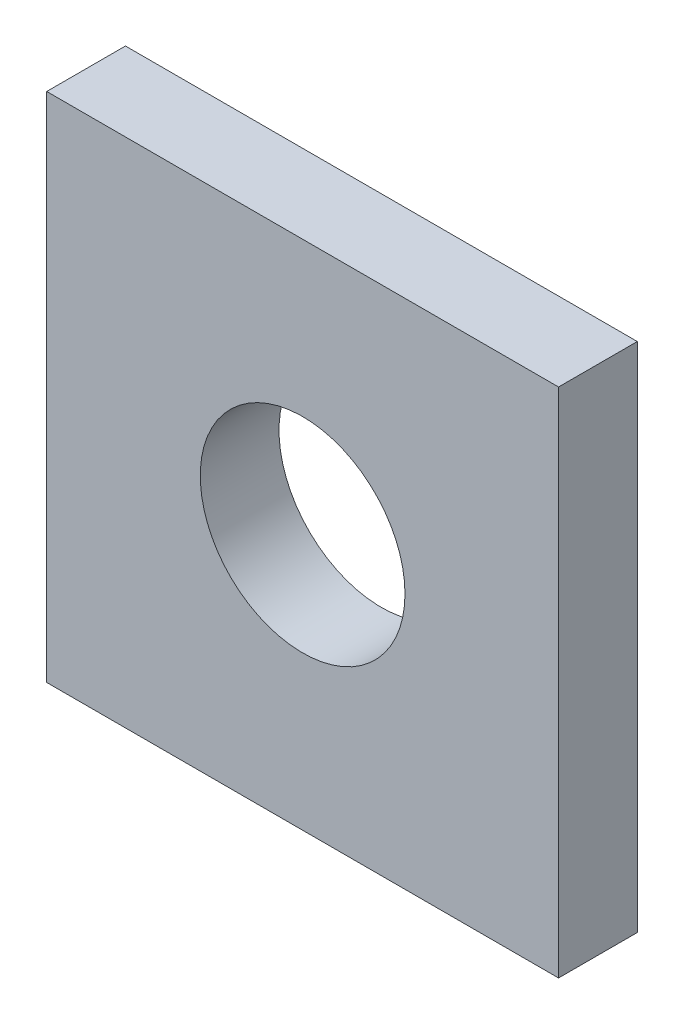
ISO-10303-21;
HEADER;
FILE_DESCRIPTION(('STEP AP214'),'2;1');
FILE_NAME('part.step','',(''),(''),'','','');
FILE_SCHEMA(('AUTOMOTIVE_DESIGN { 1 0 10303 214 1 1 1 1 }'));
ENDSEC;
DATA;
#1=APPLICATION_CONTEXT('core data for automotive mechanical design processes');
#2=APPLICATION_PROTOCOL_DEFINITION('international standard','automotive_design',2000,#1);
#3=PRODUCT_CONTEXT('',#1,'mechanical');
#4=PRODUCT('Part','Part','',(#3));
#5=PRODUCT_RELATED_PRODUCT_CATEGORY('part','',(#4));
#6=PRODUCT_DEFINITION_FORMATION('','',#4);
#7=PRODUCT_DEFINITION_CONTEXT('part definition',#1,'design');
#8=PRODUCT_DEFINITION('design','',#6,#7);
#9=PRODUCT_DEFINITION_SHAPE('','',#8);
#10=(LENGTH_UNIT() NAMED_UNIT(*) SI_UNIT(.MILLI.,.METRE.));
#11=(NAMED_UNIT(*) PLANE_ANGLE_UNIT() SI_UNIT($,.RADIAN.));
#12=(NAMED_UNIT(*) SI_UNIT($,.STERADIAN.) SOLID_ANGLE_UNIT());
#13=UNCERTAINTY_MEASURE_WITH_UNIT(LENGTH_MEASURE(1.E-05),#10,'distance_accuracy_value','');
#14=(GEOMETRIC_REPRESENTATION_CONTEXT(3) GLOBAL_UNCERTAINTY_ASSIGNED_CONTEXT((#13)) GLOBAL_UNIT_ASSIGNED_CONTEXT((#10,
#11,#12)) REPRESENTATION_CONTEXT('',''));
#15=CARTESIAN_POINT('',(0.,0.,0.));
#16=DIRECTION('',(0.,0.,1.));
#17=DIRECTION('',(1.,0.,0.));
#18=AXIS2_PLACEMENT_3D('',#15,#16,#17);
#19=CARTESIAN_POINT('',(0.,0.,0.));
#20=DIRECTION('',(0.,0.,1.));
#21=DIRECTION('',(1.,0.,0.));
#22=AXIS2_PLACEMENT_3D('',#19,#20,#21);
#23=PLANE('',#22);
#24=CARTESIAN_POINT('',(0.,0.,0.));
#25=DIRECTION('',(0.,0.,1.));
#26=DIRECTION('',(1.,0.,0.));
#27=AXIS2_PLACEMENT_3D('',#24,#25,#26);
#28=CIRCLE('',#27,2.6);
#29=CARTESIAN_POINT('',(2.6,0.,0.));
#30=VERTEX_POINT('',#29);
#31=EDGE_CURVE('E18',#30,#30,#28,.T.);
#32=ORIENTED_EDGE('',*,*,#31,.T.);
#33=EDGE_LOOP('',(#32));
#34=FACE_BOUND('',#33,.T.);
#35=DIRECTION('',(0.,1.,0.));
#36=VECTOR('',#35,1.);
#37=CARTESIAN_POINT('',(-6.5,-6.50000000000001,0.));
#38=LINE('',#37,#36);
#39=CARTESIAN_POINT('',(-6.5,6.5,0.));
#40=VERTEX_POINT('',#39);
#41=CARTESIAN_POINT('',(-6.5,-6.50000000000001,0.));
#42=VERTEX_POINT('',#41);
#43=EDGE_CURVE('E57',#40,#42,#38,.F.);
#44=ORIENTED_EDGE('',*,*,#43,.F.);
#45=DIRECTION('',(1.,0.,0.));
#46=VECTOR('',#45,1.);
#47=CARTESIAN_POINT('',(-6.5,6.5,0.));
#48=LINE('',#47,#46);
#49=CARTESIAN_POINT('',(6.5,6.5,0.));
#50=VERTEX_POINT('',#49);
#51=EDGE_CURVE('E80',#50,#40,#48,.F.);
#52=ORIENTED_EDGE('',*,*,#51,.F.);
#53=DIRECTION('',(0.,1.,0.));
#54=VECTOR('',#53,1.);
#55=CARTESIAN_POINT('',(6.5,6.50000000000001,0.));
#56=LINE('',#55,#54);
#57=CARTESIAN_POINT('',(6.5,-6.50000000000001,0.));
#58=VERTEX_POINT('',#57);
#59=EDGE_CURVE('E67',#58,#50,#56,.T.);
#60=ORIENTED_EDGE('',*,*,#59,.F.);
#61=DIRECTION('',(1.,0.,0.));
#62=VECTOR('',#61,1.);
#63=CARTESIAN_POINT('',(6.5,-6.50000000000001,0.));
#64=LINE('',#63,#62);
#65=EDGE_CURVE('E52',#42,#58,#64,.T.);
#66=ORIENTED_EDGE('',*,*,#65,.F.);
#67=EDGE_LOOP('',(#44,#52,#60,#66));
#68=FACE_BOUND('',#67,.T.);
#69=ADVANCED_FACE('F15',(#34,#68),#23,.F.);
#70=CARTESIAN_POINT('',(-6.5,-6.50000000000001,0.));
#71=DIRECTION('',(-1.,0.,0.));
#72=DIRECTION('',(0.,0.,1.));
#73=AXIS2_PLACEMENT_3D('',#70,#71,#72);
#74=PLANE('',#73);
#75=ORIENTED_EDGE('',*,*,#43,.T.);
#76=DIRECTION('',(0.,0.,-1.));
#77=VECTOR('',#76,1.);
#78=CARTESIAN_POINT('',(-6.5,-6.50000000000001,0.));
#79=LINE('',#78,#77);
#80=CARTESIAN_POINT('',(-6.5,-6.50000000000001,2.));
#81=VERTEX_POINT('',#80);
#82=EDGE_CURVE('E59',#81,#42,#79,.T.);
#83=ORIENTED_EDGE('',*,*,#82,.F.);
#84=DIRECTION('',(0.,1.,0.));
#85=VECTOR('',#84,1.);
#86=CARTESIAN_POINT('',(-6.5,0.,2.));
#87=LINE('',#86,#85);
#88=CARTESIAN_POINT('',(-6.5,6.5,2.));
#89=VERTEX_POINT('',#88);
#90=EDGE_CURVE('E83',#89,#81,#87,.F.);
#91=ORIENTED_EDGE('',*,*,#90,.F.);
#92=DIRECTION('',(0.,0.,1.));
#93=VECTOR('',#92,1.);
#94=CARTESIAN_POINT('',(-6.5,6.5,0.));
#95=LINE('',#94,#93);
#96=EDGE_CURVE('E62',#40,#89,#95,.T.);
#97=ORIENTED_EDGE('',*,*,#96,.F.);
#98=EDGE_LOOP('',(#75,#83,#91,#97));
#99=FACE_BOUND('',#98,.T.);
#100=ADVANCED_FACE('F58',(#99),#74,.T.);
#101=CARTESIAN_POINT('',(6.5,-6.50000000000001,0.));
#102=DIRECTION('',(0.,-1.,0.));
#103=DIRECTION('',(0.,0.,-1.));
#104=AXIS2_PLACEMENT_3D('',#101,#102,#103);
#105=PLANE('',#104);
#106=ORIENTED_EDGE('',*,*,#65,.T.);
#107=DIRECTION('',(0.,0.,-1.));
#108=VECTOR('',#107,1.);
#109=CARTESIAN_POINT('',(6.5,-6.50000000000001,0.));
#110=LINE('',#109,#108);
#111=CARTESIAN_POINT('',(6.5,-6.50000000000001,2.));
#112=VERTEX_POINT('',#111);
#113=EDGE_CURVE('E69',#112,#58,#110,.T.);
#114=ORIENTED_EDGE('',*,*,#113,.F.);
#115=DIRECTION('',(1.,0.,0.));
#116=VECTOR('',#115,1.);
#117=CARTESIAN_POINT('',(0.,-6.50000000000001,2.));
#118=LINE('',#117,#116);
#119=EDGE_CURVE('E73',#81,#112,#118,.T.);
#120=ORIENTED_EDGE('',*,*,#119,.F.);
#121=ORIENTED_EDGE('',*,*,#82,.T.);
#122=EDGE_LOOP('',(#106,#114,#120,#121));
#123=FACE_BOUND('',#122,.T.);
#124=ADVANCED_FACE('F71',(#123),#105,.T.);
#125=CARTESIAN_POINT('',(6.5,6.50000000000001,0.));
#126=DIRECTION('',(1.,0.,0.));
#127=DIRECTION('',(0.,0.,-1.));
#128=AXIS2_PLACEMENT_3D('',#125,#126,#127);
#129=PLANE('',#128);
#130=ORIENTED_EDGE('',*,*,#59,.T.);
#131=DIRECTION('',(0.,0.,1.));
#132=VECTOR('',#131,1.);
#133=CARTESIAN_POINT('',(6.5,6.5,0.));
#134=LINE('',#133,#132);
#135=CARTESIAN_POINT('',(6.5,6.5,2.));
#136=VERTEX_POINT('',#135);
#137=EDGE_CURVE('E32',#136,#50,#134,.F.);
#138=ORIENTED_EDGE('',*,*,#137,.F.);
#139=DIRECTION('',(0.,1.,0.));
#140=VECTOR('',#139,1.);
#141=CARTESIAN_POINT('',(6.5,0.,2.));
#142=LINE('',#141,#140);
#143=EDGE_CURVE('E86',#112,#136,#142,.T.);
#144=ORIENTED_EDGE('',*,*,#143,.F.);
#145=ORIENTED_EDGE('',*,*,#113,.T.);
#146=EDGE_LOOP('',(#130,#138,#144,#145));
#147=FACE_BOUND('',#146,.T.);
#148=ADVANCED_FACE('F96',(#147),#129,.T.);
#149=CARTESIAN_POINT('',(-6.5,6.5,0.));
#150=DIRECTION('',(0.,1.,0.));
#151=DIRECTION('',(0.,0.,1.));
#152=AXIS2_PLACEMENT_3D('',#149,#150,#151);
#153=PLANE('',#152);
#154=ORIENTED_EDGE('',*,*,#51,.T.);
#155=ORIENTED_EDGE('',*,*,#96,.T.);
#156=DIRECTION('',(1.,0.,0.));
#157=VECTOR('',#156,1.);
#158=CARTESIAN_POINT('',(0.,6.50000000000001,2.));
#159=LINE('',#158,#157);
#160=EDGE_CURVE('E24',#136,#89,#159,.F.);
#161=ORIENTED_EDGE('',*,*,#160,.F.);
#162=ORIENTED_EDGE('',*,*,#137,.T.);
#163=EDGE_LOOP('',(#154,#155,#161,#162));
#164=FACE_BOUND('',#163,.T.);
#165=ADVANCED_FACE('F93',(#164),#153,.T.);
#166=CARTESIAN_POINT('',(0.,0.,0.));
#167=DIRECTION('',(0.,0.,1.));
#168=DIRECTION('',(1.,0.,0.));
#169=AXIS2_PLACEMENT_3D('',#166,#167,#168);
#170=CYLINDRICAL_SURFACE('',#169,2.6);
#171=ORIENTED_EDGE('',*,*,#31,.F.);
#172=EDGE_LOOP('',(#171));
#173=FACE_BOUND('',#172,.T.);
#174=CARTESIAN_POINT('',(0.,0.,2.));
#175=DIRECTION('',(0.,0.,1.));
#176=DIRECTION('',(1.,0.,0.));
#177=AXIS2_PLACEMENT_3D('',#174,#175,#176);
#178=CIRCLE('',#177,2.6);
#179=CARTESIAN_POINT('',(2.6,0.,2.));
#180=VERTEX_POINT('',#179);
#181=EDGE_CURVE('E10',#180,#180,#178,.F.);
#182=ORIENTED_EDGE('',*,*,#181,.F.);
#183=EDGE_LOOP('',(#182));
#184=FACE_BOUND('',#183,.T.);
#185=ADVANCED_FACE('F95',(#173,#184),#170,.F.);
#186=CARTESIAN_POINT('',(0.,0.,2.));
#187=DIRECTION('',(0.,0.,1.));
#188=DIRECTION('',(1.,0.,0.));
#189=AXIS2_PLACEMENT_3D('',#186,#187,#188);
#190=PLANE('',#189);
#191=ORIENTED_EDGE('',*,*,#181,.T.);
#192=EDGE_LOOP('',(#191));
#193=FACE_BOUND('',#192,.T.);
#194=ORIENTED_EDGE('',*,*,#143,.T.);
#195=ORIENTED_EDGE('',*,*,#160,.T.);
#196=ORIENTED_EDGE('',*,*,#90,.T.);
#197=ORIENTED_EDGE('',*,*,#119,.T.);
#198=EDGE_LOOP('',(#194,#195,#196,#197));
#199=FACE_BOUND('',#198,.T.);
#200=ADVANCED_FACE('F91',(#193,#199),#190,.T.);
#201=CLOSED_SHELL('',(#69,#100,#124,#148,#165,#185,#200));
#202=MANIFOLD_SOLID_BREP('B1',#201);
#203=ADVANCED_BREP_SHAPE_REPRESENTATION('',(#18,#202),#14);
#204=SHAPE_DEFINITION_REPRESENTATION(#9,#203);
ENDSEC;
END-ISO-10303-21;
